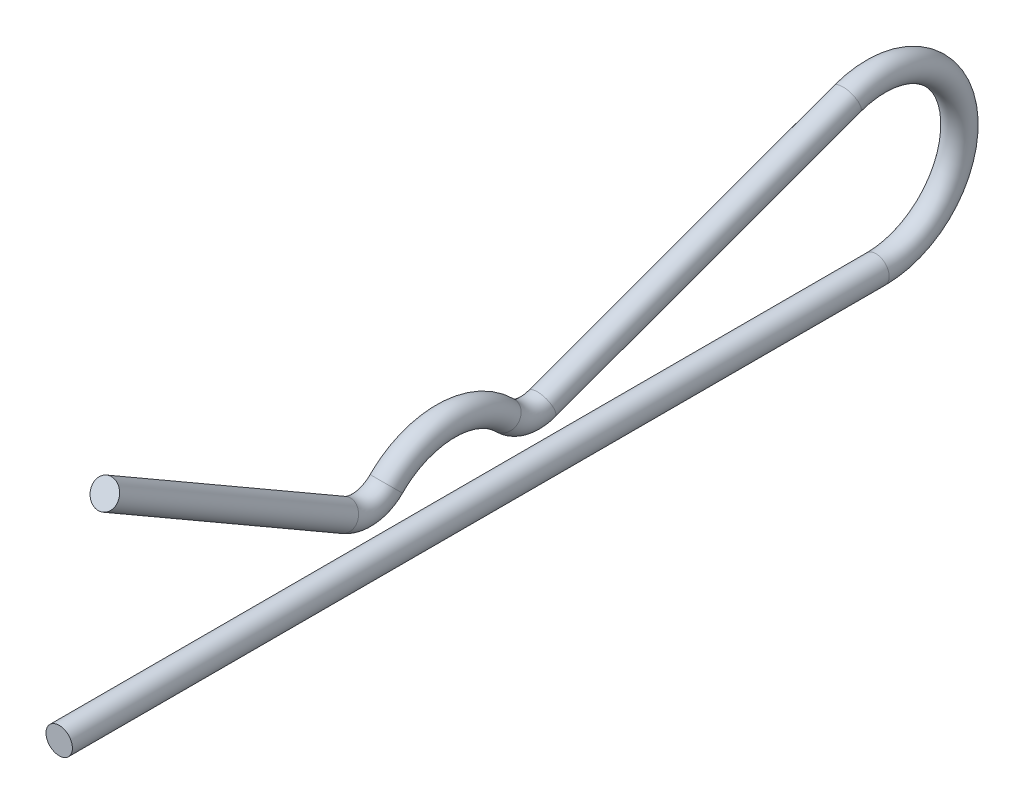
ISO-10303-21;
HEADER;
FILE_DESCRIPTION(('STEP AP214'),'2;1');
FILE_NAME('part.step','',(''),(''),'','','');
FILE_SCHEMA(('AUTOMOTIVE_DESIGN { 1 0 10303 214 1 1 1 1 }'));
ENDSEC;
DATA;
#1=APPLICATION_CONTEXT('core data for automotive mechanical design processes');
#2=APPLICATION_PROTOCOL_DEFINITION('international standard','automotive_design',2000,#1);
#3=PRODUCT_CONTEXT('',#1,'mechanical');
#4=PRODUCT('Part','Part','',(#3));
#5=PRODUCT_RELATED_PRODUCT_CATEGORY('part','',(#4));
#6=PRODUCT_DEFINITION_FORMATION('','',#4);
#7=PRODUCT_DEFINITION_CONTEXT('part definition',#1,'design');
#8=PRODUCT_DEFINITION('design','',#6,#7);
#9=PRODUCT_DEFINITION_SHAPE('','',#8);
#10=(LENGTH_UNIT() NAMED_UNIT(*) SI_UNIT(.MILLI.,.METRE.));
#11=(NAMED_UNIT(*) PLANE_ANGLE_UNIT() SI_UNIT($,.RADIAN.));
#12=(NAMED_UNIT(*) SI_UNIT($,.STERADIAN.) SOLID_ANGLE_UNIT());
#13=UNCERTAINTY_MEASURE_WITH_UNIT(LENGTH_MEASURE(1.E-05),#10,'distance_accuracy_value','');
#14=(GEOMETRIC_REPRESENTATION_CONTEXT(3) GLOBAL_UNCERTAINTY_ASSIGNED_CONTEXT((#13)) GLOBAL_UNIT_ASSIGNED_CONTEXT((#10,
#11,#12)) REPRESENTATION_CONTEXT('',''));
#15=CARTESIAN_POINT('',(0.,0.,0.));
#16=DIRECTION('',(0.,0.,1.));
#17=DIRECTION('',(1.,0.,0.));
#18=AXIS2_PLACEMENT_3D('',#15,#16,#17);
#19=CARTESIAN_POINT('',(0.,-3.7719,20.6375));
#20=DIRECTION('',(0.,0.,1.));
#21=DIRECTION('',(1.,0.,0.));
#22=AXIS2_PLACEMENT_3D('',#19,#20,#21);
#23=PLANE('',#22);
#24=CARTESIAN_POINT('',(0.,-3.7719,20.6375));
#25=DIRECTION('',(0.,0.,1.));
#26=DIRECTION('',(1.,0.,0.));
#27=AXIS2_PLACEMENT_3D('',#24,#25,#26);
#28=CIRCLE('',#27,0.596900000000001);
#29=CARTESIAN_POINT('',(0.596900000000001,-3.7719,20.6375));
#30=VERTEX_POINT('',#29);
#31=EDGE_CURVE('E44',#30,#30,#28,.T.);
#32=ORIENTED_EDGE('',*,*,#31,.T.);
#33=EDGE_LOOP('',(#32));
#34=FACE_BOUND('',#33,.T.);
#35=ADVANCED_FACE('F32',(#34),#23,.T.);
#36=CARTESIAN_POINT('',(0.,4.8592089307571,18.57375));
#37=DIRECTION('',(0.,-0.499999999999991,-0.866025403784444));
#38=DIRECTION('',(1.,0.,0.));
#39=AXIS2_PLACEMENT_3D('',#36,#37,#38);
#40=PLANE('',#39);
#41=CARTESIAN_POINT('',(0.,4.8592089307571,18.57375));
#42=DIRECTION('',(0.,-0.499999999999991,-0.866025403784444));
#43=DIRECTION('',(1.,0.,0.));
#44=AXIS2_PLACEMENT_3D('',#41,#42,#43);
#45=CIRCLE('',#44,0.596900000000001);
#46=CARTESIAN_POINT('',(0.596900000000001,4.8592089307571,18.57375));
#47=VERTEX_POINT('',#46);
#48=EDGE_CURVE('E11',#47,#47,#45,.T.);
#49=ORIENTED_EDGE('',*,*,#48,.F.);
#50=EDGE_LOOP('',(#49));
#51=FACE_BOUND('',#50,.T.);
#52=ADVANCED_FACE('F50',(#51),#40,.F.);
#53=CARTESIAN_POINT('',(0.,-3.7719,20.6375));
#54=DIRECTION('',(0.,0.,-1.));
#55=DIRECTION('',(0.,1.,0.));
#56=AXIS2_PLACEMENT_3D('',#53,#54,#55);
#57=CYLINDRICAL_SURFACE('',#56,0.596900000000001);
#58=CARTESIAN_POINT('',(0.,-3.77189999999999,-16.2687));
#59=DIRECTION('',(0.,0.,1.));
#60=DIRECTION('',(1.,0.,0.));
#61=AXIS2_PLACEMENT_3D('',#58,#59,#60);
#62=CIRCLE('',#61,0.596900000000001);
#63=CARTESIAN_POINT('',(0.,-4.36879999999998,-16.2687));
#64=VERTEX_POINT('',#63);
#65=EDGE_CURVE('E92',#64,#64,#62,.T.);
#66=ORIENTED_EDGE('',*,*,#65,.T.);
#67=EDGE_LOOP('',(#66));
#68=FACE_BOUND('',#67,.T.);
#69=ORIENTED_EDGE('',*,*,#31,.F.);
#70=EDGE_LOOP('',(#69));
#71=FACE_BOUND('',#70,.T.);
#72=ADVANCED_FACE('F52',(#68,#71),#57,.T.);
#73=CARTESIAN_POINT('',(0.,0.,-16.2687));
#74=DIRECTION('',(1.,0.,0.));
#75=DIRECTION('',(0.,0.,-1.));
#76=AXIS2_PLACEMENT_3D('',#73,#74,#75);
#77=TOROIDAL_SURFACE('',#76,3.77189999999999,0.596900000000001);
#78=CARTESIAN_POINT('',(0.,3.54341968497796,-14.9758711071798));
#79=DIRECTION('',(0.,0.342752695675985,-0.939425670080846));
#80=DIRECTION('',(1.,0.,0.));
#81=AXIS2_PLACEMENT_3D('',#78,#79,#80);
#82=CIRCLE('',#81,0.596900000000001);
#83=CARTESIAN_POINT('',(0.,4.1041628674492,-14.7712820231308));
#84=VERTEX_POINT('',#83);
#85=EDGE_CURVE('E89',#84,#84,#82,.T.);
#86=CARTESIAN_POINT('',(0.,0.,-16.2687));
#87=DIRECTION('',(1.,0.,0.));
#88=DIRECTION('',(0.,0.,-1.));
#89=AXIS2_PLACEMENT_3D('',#86,#87,#88);
#90=CIRCLE('',#89,4.36879999999999);
#91=EDGE_CURVE('',#64,#84,#90,.T.);
#92=ORIENTED_EDGE('',*,*,#65,.F.);
#93=ORIENTED_EDGE('',*,*,#85,.T.);
#94=ORIENTED_EDGE('',*,*,#91,.T.);
#95=ORIENTED_EDGE('',*,*,#91,.F.);
#96=EDGE_LOOP('',(#92,#94,#93,#95));
#97=FACE_BOUND('',#96,.T.);
#98=ADVANCED_FACE('F57',(#97),#77,.T.);
#99=CARTESIAN_POINT('',(0.,3.54341968497796,-14.9758711071797));
#100=DIRECTION('',(0.,-0.342752695675985,0.939425670080846));
#101=DIRECTION('',(0.,-0.939425670080846,-0.342752695675985));
#102=AXIS2_PLACEMENT_3D('',#99,#100,#101);
#103=CYLINDRICAL_SURFACE('',#102,0.596900000000001);
#104=CARTESIAN_POINT('',(0.,-1.49133825125334,-1.17647315172163));
#105=DIRECTION('',(0.,0.342752695675985,-0.939425670080846));
#106=DIRECTION('',(1.,0.,0.));
#107=AXIS2_PLACEMENT_3D('',#104,#105,#106);
#108=CIRCLE('',#107,0.596900000000001);
#109=CARTESIAN_POINT('',(0.,-2.0520814337246,-1.38106223577062));
#110=VERTEX_POINT('',#109);
#111=EDGE_CURVE('E94',#110,#110,#108,.T.);
#112=ORIENTED_EDGE('',*,*,#111,.T.);
#113=EDGE_LOOP('',(#112));
#114=FACE_BOUND('',#113,.T.);
#115=ORIENTED_EDGE('',*,*,#85,.F.);
#116=EDGE_LOOP('',(#115));
#117=FACE_BOUND('',#116,.T.);
#118=ADVANCED_FACE('F77',(#114,#117),#103,.T.);
#119=CARTESIAN_POINT('',(0.,0.,-0.632353247336005));
#120=DIRECTION('',(-1.,0.,0.));
#121=DIRECTION('',(0.,0.,1.));
#122=AXIS2_PLACEMENT_3D('',#119,#120,#121);
#123=TOROIDAL_SURFACE('',#122,1.5875,0.596900000000001);
#124=CARTESIAN_POINT('',(0.,-1.11726895734597,0.495417264315651));
#125=DIRECTION('',(0.,-0.710406621512856,-0.703791469194313));
#126=DIRECTION('',(1.,0.,0.));
#127=AXIS2_PLACEMENT_3D('',#124,#125,#126);
#128=CIRCLE('',#127,0.596900000000001);
#129=CARTESIAN_POINT('',(0.,-1.53736208530806,0.919458976696677));
#130=VERTEX_POINT('',#129);
#131=EDGE_CURVE('E100',#130,#130,#128,.T.);
#132=CARTESIAN_POINT('',(0.,0.,-0.632353247336005));
#133=DIRECTION('',(-1.,0.,0.));
#134=DIRECTION('',(0.,0.,1.));
#135=AXIS2_PLACEMENT_3D('',#132,#133,#134);
#136=CIRCLE('',#135,2.1844);
#137=EDGE_CURVE('',#110,#130,#136,.T.);
#138=ORIENTED_EDGE('',*,*,#111,.F.);
#139=ORIENTED_EDGE('',*,*,#131,.T.);
#140=ORIENTED_EDGE('',*,*,#137,.T.);
#141=ORIENTED_EDGE('',*,*,#137,.F.);
#142=EDGE_LOOP('',(#138,#140,#139,#141));
#143=FACE_BOUND('',#142,.T.);
#144=ADVANCED_FACE('F73',(#143),#123,.T.);
#145=CARTESIAN_POINT('',(0.,-3.7719,3.175));
#146=DIRECTION('',(1.,0.,0.));
#147=DIRECTION('',(0.,0.,-1.));
#148=AXIS2_PLACEMENT_3D('',#145,#146,#147);
#149=TOROIDAL_SURFACE('',#148,3.7719,0.596900000000001);
#150=CARTESIAN_POINT('',(0.,-1.11726895734597,5.85458273568434));
#151=DIRECTION('',(0.,0.710406621512856,-0.703791469194313));
#152=DIRECTION('',(1.,0.,0.));
#153=AXIS2_PLACEMENT_3D('',#150,#151,#152);
#154=CIRCLE('',#153,0.596900000000001);
#155=CARTESIAN_POINT('',(0.,-1.53736208530806,5.43054102330332));
#156=VERTEX_POINT('',#155);
#157=EDGE_CURVE('E103',#156,#156,#154,.T.);
#158=ORIENTED_EDGE('',*,*,#157,.T.);
#159=EDGE_LOOP('',(#158));
#160=FACE_BOUND('',#159,.T.);
#161=ORIENTED_EDGE('',*,*,#131,.F.);
#162=EDGE_LOOP('',(#161));
#163=FACE_BOUND('',#162,.T.);
#164=ADVANCED_FACE('F67',(#160,#163),#149,.T.);
#165=CARTESIAN_POINT('',(0.,0.,6.982353247336));
#166=DIRECTION('',(-1.,0.,0.));
#167=DIRECTION('',(0.,0.,1.));
#168=AXIS2_PLACEMENT_3D('',#165,#166,#167);
#169=TOROIDAL_SURFACE('',#168,1.5875,0.596900000000001);
#170=CARTESIAN_POINT('',(0.,-1.3748153285078,7.77610324733599));
#171=DIRECTION('',(0.,-0.499999999999993,-0.866025403784443));
#172=DIRECTION('',(1.,0.,0.));
#173=AXIS2_PLACEMENT_3D('',#170,#171,#172);
#174=CIRCLE('',#173,0.596900000000001);
#175=CARTESIAN_POINT('',(0.,-1.89174589202674,8.07455324733598));
#176=VERTEX_POINT('',#175);
#177=EDGE_CURVE('E39',#176,#176,#174,.T.);
#178=CARTESIAN_POINT('',(0.,0.,6.982353247336));
#179=DIRECTION('',(-1.,0.,0.));
#180=DIRECTION('',(0.,0.,1.));
#181=AXIS2_PLACEMENT_3D('',#178,#179,#180);
#182=CIRCLE('',#181,2.1844);
#183=EDGE_CURVE('',#156,#176,#182,.T.);
#184=ORIENTED_EDGE('',*,*,#157,.F.);
#185=ORIENTED_EDGE('',*,*,#177,.T.);
#186=ORIENTED_EDGE('',*,*,#183,.T.);
#187=ORIENTED_EDGE('',*,*,#183,.F.);
#188=EDGE_LOOP('',(#184,#186,#185,#187));
#189=FACE_BOUND('',#188,.T.);
#190=ADVANCED_FACE('F63',(#189),#169,.T.);
#191=CARTESIAN_POINT('',(0.,-1.37481532850781,7.77610324733599));
#192=DIRECTION('',(0.,0.499999999999991,0.866025403784444));
#193=DIRECTION('',(0.,-0.866025403784444,0.499999999999991));
#194=AXIS2_PLACEMENT_3D('',#191,#192,#193);
#195=CYLINDRICAL_SURFACE('',#194,0.596900000000001);
#196=ORIENTED_EDGE('',*,*,#48,.T.);
#197=EDGE_LOOP('',(#196));
#198=FACE_BOUND('',#197,.T.);
#199=ORIENTED_EDGE('',*,*,#177,.F.);
#200=EDGE_LOOP('',(#199));
#201=FACE_BOUND('',#200,.T.);
#202=ADVANCED_FACE('F47',(#198,#201),#195,.T.);
#203=CLOSED_SHELL('',(#35,#52,#72,#98,#118,#144,#164,#190,#202));
#204=MANIFOLD_SOLID_BREP('B2',#203);
#205=ADVANCED_BREP_SHAPE_REPRESENTATION('',(#18,#204),#14);
#206=SHAPE_DEFINITION_REPRESENTATION(#9,#205);
ENDSEC;
END-ISO-10303-21;
